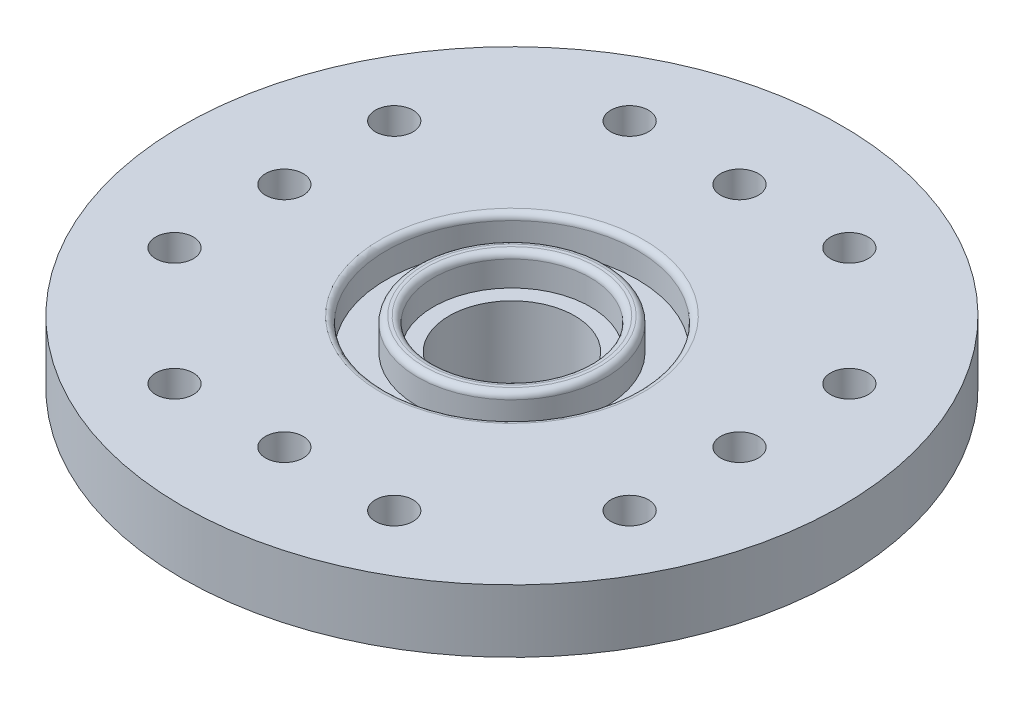
ISO-10303-21;
HEADER;
FILE_DESCRIPTION(('STEP AP214'),'2;1');
FILE_NAME('part.step','',(''),(''),'','','');
FILE_SCHEMA(('AUTOMOTIVE_DESIGN { 1 0 10303 214 1 1 1 1 }'));
ENDSEC;
DATA;
#1=APPLICATION_CONTEXT('core data for automotive mechanical design processes');
#2=APPLICATION_PROTOCOL_DEFINITION('international standard','automotive_design',2000,#1);
#3=PRODUCT_CONTEXT('',#1,'mechanical');
#4=PRODUCT('Part','Part','',(#3));
#5=PRODUCT_RELATED_PRODUCT_CATEGORY('part','',(#4));
#6=PRODUCT_DEFINITION_FORMATION('','',#4);
#7=PRODUCT_DEFINITION_CONTEXT('part definition',#1,'design');
#8=PRODUCT_DEFINITION('design','',#6,#7);
#9=PRODUCT_DEFINITION_SHAPE('','',#8);
#10=(LENGTH_UNIT() NAMED_UNIT(*) SI_UNIT(.MILLI.,.METRE.));
#11=(NAMED_UNIT(*) PLANE_ANGLE_UNIT() SI_UNIT($,.RADIAN.));
#12=(NAMED_UNIT(*) SI_UNIT($,.STERADIAN.) SOLID_ANGLE_UNIT());
#13=UNCERTAINTY_MEASURE_WITH_UNIT(LENGTH_MEASURE(1.E-05),#10,'distance_accuracy_value','');
#14=(GEOMETRIC_REPRESENTATION_CONTEXT(3) GLOBAL_UNCERTAINTY_ASSIGNED_CONTEXT((#13)) GLOBAL_UNIT_ASSIGNED_CONTEXT((#10,
#11,#12)) REPRESENTATION_CONTEXT('',''));
#15=CARTESIAN_POINT('',(0.,0.,0.));
#16=DIRECTION('',(0.,0.,1.));
#17=DIRECTION('',(1.,0.,0.));
#18=AXIS2_PLACEMENT_3D('',#15,#16,#17);
#19=CARTESIAN_POINT('',(0.,-3.,0.));
#20=DIRECTION('',(0.,1.,0.));
#21=DIRECTION('',(0.,0.,1.));
#22=AXIS2_PLACEMENT_3D('',#19,#20,#21);
#23=CYLINDRICAL_SURFACE('',#22,2.);
#24=CARTESIAN_POINT('',(0.,-3.,0.));
#25=DIRECTION('',(0.,-1.,0.));
#26=DIRECTION('',(0.,0.,-1.));
#27=AXIS2_PLACEMENT_3D('',#24,#25,#26);
#28=CIRCLE('',#27,2.);
#29=CARTESIAN_POINT('',(0.,-3.,-2.));
#30=VERTEX_POINT('',#29);
#31=EDGE_CURVE('E153',#30,#30,#28,.T.);
#32=ORIENTED_EDGE('',*,*,#31,.T.);
#33=EDGE_LOOP('',(#32));
#34=FACE_BOUND('',#33,.T.);
#35=CARTESIAN_POINT('',(0.,1.,0.));
#36=DIRECTION('',(0.,1.,0.));
#37=DIRECTION('',(0.,0.,1.));
#38=AXIS2_PLACEMENT_3D('',#35,#36,#37);
#39=CIRCLE('',#38,2.);
#40=CARTESIAN_POINT('',(0.,1.,2.));
#41=VERTEX_POINT('',#40);
#42=EDGE_CURVE('E132',#41,#41,#39,.T.);
#43=ORIENTED_EDGE('',*,*,#42,.T.);
#44=EDGE_LOOP('',(#43));
#45=FACE_BOUND('',#44,.T.);
#46=ADVANCED_FACE('F36',(#34,#45),#23,.F.);
#47=CARTESIAN_POINT('',(0.,2.,0.));
#48=DIRECTION('',(0.,-1.,0.));
#49=DIRECTION('',(0.,0.,-1.));
#50=AXIS2_PLACEMENT_3D('',#47,#48,#49);
#51=CYLINDRICAL_SURFACE('',#50,10.5);
#52=CARTESIAN_POINT('',(0.,2.,0.));
#53=DIRECTION('',(0.,1.,0.));
#54=DIRECTION('',(0.,0.,1.));
#55=AXIS2_PLACEMENT_3D('',#52,#53,#54);
#56=CIRCLE('',#55,10.5);
#57=CARTESIAN_POINT('',(0.,2.,10.5));
#58=VERTEX_POINT('',#57);
#59=EDGE_CURVE('E148',#58,#58,#56,.T.);
#60=ORIENTED_EDGE('',*,*,#59,.F.);
#61=EDGE_LOOP('',(#60));
#62=FACE_BOUND('',#61,.T.);
#63=CARTESIAN_POINT('',(0.,0.,0.));
#64=DIRECTION('',(0.,1.,0.));
#65=DIRECTION('',(0.,0.,1.));
#66=AXIS2_PLACEMENT_3D('',#63,#64,#65);
#67=CIRCLE('',#66,10.5);
#68=CARTESIAN_POINT('',(0.,0.,10.5));
#69=VERTEX_POINT('',#68);
#70=EDGE_CURVE('E149',#69,#69,#67,.T.);
#71=ORIENTED_EDGE('',*,*,#70,.T.);
#72=EDGE_LOOP('',(#71));
#73=FACE_BOUND('',#72,.T.);
#74=ADVANCED_FACE('F211',(#62,#73),#51,.T.);
#75=CARTESIAN_POINT('',(0.,2.,0.));
#76=DIRECTION('',(0.,1.,0.));
#77=DIRECTION('',(0.,0.,1.));
#78=AXIS2_PLACEMENT_3D('',#75,#76,#77);
#79=PLANE('',#78);
#80=CARTESIAN_POINT('',(0.,2.,0.));
#81=DIRECTION('',(0.,1.,0.));
#82=DIRECTION('',(0.,0.,1.));
#83=AXIS2_PLACEMENT_3D('',#80,#81,#82);
#84=CIRCLE('',#83,4.2);
#85=CARTESIAN_POINT('',(0.,2.,4.2));
#86=VERTEX_POINT('',#85);
#87=EDGE_CURVE('E10',#86,#86,#84,.F.);
#88=ORIENTED_EDGE('',*,*,#87,.T.);
#89=EDGE_LOOP('',(#88));
#90=FACE_BOUND('',#89,.T.);
#91=CARTESIAN_POINT('',(7.24999999999994,2.,-3.50000000000008));
#92=DIRECTION('',(0.,1.,0.));
#93=DIRECTION('',(-1.,0.,0.));
#94=AXIS2_PLACEMENT_3D('',#91,#92,#93);
#95=CIRCLE('',#94,0.6);
#96=CARTESIAN_POINT('',(6.64999999999994,2.,-3.50000000000007));
#97=VERTEX_POINT('',#96);
#98=EDGE_CURVE('E77',#97,#97,#95,.T.);
#99=ORIENTED_EDGE('',*,*,#98,.F.);
#100=EDGE_LOOP('',(#99));
#101=FACE_BOUND('',#100,.T.);
#102=CARTESIAN_POINT('',(7.25000000000004,2.,3.49999999999992));
#103=DIRECTION('',(0.,1.,0.));
#104=DIRECTION('',(-1.,0.,0.));
#105=AXIS2_PLACEMENT_3D('',#102,#103,#104);
#106=CIRCLE('',#105,0.6);
#107=CARTESIAN_POINT('',(6.65000000000004,2.,3.49999999999993));
#108=VERTEX_POINT('',#107);
#109=EDGE_CURVE('E76',#108,#108,#106,.T.);
#110=ORIENTED_EDGE('',*,*,#109,.F.);
#111=EDGE_LOOP('',(#110));
#112=FACE_BOUND('',#111,.T.);
#113=CARTESIAN_POINT('',(7.25,2.,0.));
#114=DIRECTION('',(0.,1.,0.));
#115=DIRECTION('',(-1.,0.,0.));
#116=AXIS2_PLACEMENT_3D('',#113,#114,#115);
#117=CIRCLE('',#116,0.6);
#118=CARTESIAN_POINT('',(6.65,2.,0.));
#119=VERTEX_POINT('',#118);
#120=EDGE_CURVE('E82',#119,#119,#117,.T.);
#121=ORIENTED_EDGE('',*,*,#120,.F.);
#122=EDGE_LOOP('',(#121));
#123=FACE_BOUND('',#122,.T.);
#124=CARTESIAN_POINT('',(3.5,2.,7.24999999999998));
#125=DIRECTION('',(0.,1.,0.));
#126=DIRECTION('',(0.,0.,-1.));
#127=AXIS2_PLACEMENT_3D('',#124,#125,#126);
#128=CIRCLE('',#127,0.6);
#129=CARTESIAN_POINT('',(3.5,2.,6.64999999999998));
#130=VERTEX_POINT('',#129);
#131=EDGE_CURVE('E86',#130,#130,#128,.T.);
#132=ORIENTED_EDGE('',*,*,#131,.F.);
#133=EDGE_LOOP('',(#132));
#134=FACE_BOUND('',#133,.T.);
#135=CARTESIAN_POINT('',(-3.5,2.,7.25));
#136=DIRECTION('',(0.,1.,0.));
#137=DIRECTION('',(0.,0.,-1.));
#138=AXIS2_PLACEMENT_3D('',#135,#136,#137);
#139=CIRCLE('',#138,0.6);
#140=CARTESIAN_POINT('',(-3.5,2.,6.65));
#141=VERTEX_POINT('',#140);
#142=EDGE_CURVE('E91',#141,#141,#139,.T.);
#143=ORIENTED_EDGE('',*,*,#142,.F.);
#144=EDGE_LOOP('',(#143));
#145=FACE_BOUND('',#144,.T.);
#146=CARTESIAN_POINT('',(0.,2.,7.25));
#147=DIRECTION('',(0.,1.,0.));
#148=DIRECTION('',(0.,0.,-1.));
#149=AXIS2_PLACEMENT_3D('',#146,#147,#148);
#150=CIRCLE('',#149,0.6);
#151=CARTESIAN_POINT('',(0.,2.,6.65));
#152=VERTEX_POINT('',#151);
#153=EDGE_CURVE('E96',#152,#152,#150,.T.);
#154=ORIENTED_EDGE('',*,*,#153,.F.);
#155=EDGE_LOOP('',(#154));
#156=FACE_BOUND('',#155,.T.);
#157=CARTESIAN_POINT('',(-7.24999999999996,2.,3.50000000000003));
#158=DIRECTION('',(0.,1.,0.));
#159=DIRECTION('',(1.,0.,0.));
#160=AXIS2_PLACEMENT_3D('',#157,#158,#159);
#161=CIRCLE('',#160,0.6);
#162=CARTESIAN_POINT('',(-6.64999999999996,2.,3.50000000000002));
#163=VERTEX_POINT('',#162);
#164=EDGE_CURVE('E101',#163,#163,#161,.T.);
#165=ORIENTED_EDGE('',*,*,#164,.F.);
#166=EDGE_LOOP('',(#165));
#167=FACE_BOUND('',#166,.T.);
#168=CARTESIAN_POINT('',(-7.25000000000001,2.,-3.49999999999998));
#169=DIRECTION('',(0.,1.,0.));
#170=DIRECTION('',(1.,0.,0.));
#171=AXIS2_PLACEMENT_3D('',#168,#169,#170);
#172=CIRCLE('',#171,0.6);
#173=CARTESIAN_POINT('',(-6.65000000000001,2.,-3.49999999999998));
#174=VERTEX_POINT('',#173);
#175=EDGE_CURVE('E106',#174,#174,#172,.T.);
#176=ORIENTED_EDGE('',*,*,#175,.F.);
#177=EDGE_LOOP('',(#176));
#178=FACE_BOUND('',#177,.T.);
#179=CARTESIAN_POINT('',(-7.25,2.,0.));
#180=DIRECTION('',(0.,1.,0.));
#181=DIRECTION('',(1.,0.,0.));
#182=AXIS2_PLACEMENT_3D('',#179,#180,#181);
#183=CIRCLE('',#182,0.6);
#184=CARTESIAN_POINT('',(-6.65,2.,0.));
#185=VERTEX_POINT('',#184);
#186=EDGE_CURVE('E111',#185,#185,#183,.T.);
#187=ORIENTED_EDGE('',*,*,#186,.F.);
#188=EDGE_LOOP('',(#187));
#189=FACE_BOUND('',#188,.T.);
#190=CARTESIAN_POINT('',(-3.5,2.,-7.24999999999998));
#191=DIRECTION('',(0.,1.,0.));
#192=DIRECTION('',(0.,0.,1.));
#193=AXIS2_PLACEMENT_3D('',#190,#191,#192);
#194=CIRCLE('',#193,0.6);
#195=CARTESIAN_POINT('',(-3.5,2.,-6.64999999999998));
#196=VERTEX_POINT('',#195);
#197=EDGE_CURVE('E116',#196,#196,#194,.T.);
#198=ORIENTED_EDGE('',*,*,#197,.F.);
#199=EDGE_LOOP('',(#198));
#200=FACE_BOUND('',#199,.T.);
#201=CARTESIAN_POINT('',(3.5,2.,-7.25));
#202=DIRECTION('',(0.,1.,0.));
#203=DIRECTION('',(0.,0.,1.));
#204=AXIS2_PLACEMENT_3D('',#201,#202,#203);
#205=CIRCLE('',#204,0.6);
#206=CARTESIAN_POINT('',(3.5,2.,-6.65));
#207=VERTEX_POINT('',#206);
#208=EDGE_CURVE('E121',#207,#207,#205,.T.);
#209=ORIENTED_EDGE('',*,*,#208,.F.);
#210=EDGE_LOOP('',(#209));
#211=FACE_BOUND('',#210,.T.);
#212=CARTESIAN_POINT('',(0.,2.,-7.25));
#213=DIRECTION('',(0.,1.,0.));
#214=DIRECTION('',(0.,0.,1.));
#215=AXIS2_PLACEMENT_3D('',#212,#213,#214);
#216=CIRCLE('',#215,0.6);
#217=CARTESIAN_POINT('',(0.,2.,-6.65));
#218=VERTEX_POINT('',#217);
#219=EDGE_CURVE('E126',#218,#218,#216,.T.);
#220=ORIENTED_EDGE('',*,*,#219,.F.);
#221=EDGE_LOOP('',(#220));
#222=FACE_BOUND('',#221,.T.);
#223=ORIENTED_EDGE('',*,*,#59,.T.);
#224=EDGE_LOOP('',(#223));
#225=FACE_BOUND('',#224,.T.);
#226=ADVANCED_FACE('F207',(#90,#101,#112,#123,#134,#145,#156,#167,#178,#189,#200,#211,#222,
#225),#79,.T.);
#227=CARTESIAN_POINT('',(0.,0.,0.));
#228=DIRECTION('',(0.,1.,0.));
#229=DIRECTION('',(0.,0.,1.));
#230=AXIS2_PLACEMENT_3D('',#227,#228,#229);
#231=PLANE('',#230);
#232=CARTESIAN_POINT('',(7.24999999999994,0.,-3.50000000000008));
#233=DIRECTION('',(0.,1.,0.));
#234=DIRECTION('',(0.,0.,1.));
#235=AXIS2_PLACEMENT_3D('',#232,#233,#234);
#236=CIRCLE('',#235,0.6);
#237=CARTESIAN_POINT('',(7.24999999999994,0.,-2.90000000000008));
#238=VERTEX_POINT('',#237);
#239=EDGE_CURVE('E72',#238,#238,#236,.T.);
#240=ORIENTED_EDGE('',*,*,#239,.T.);
#241=EDGE_LOOP('',(#240));
#242=FACE_BOUND('',#241,.T.);
#243=CARTESIAN_POINT('',(7.25000000000004,0.,3.49999999999992));
#244=DIRECTION('',(0.,1.,0.));
#245=DIRECTION('',(0.,0.,1.));
#246=AXIS2_PLACEMENT_3D('',#243,#244,#245);
#247=CIRCLE('',#246,0.6);
#248=CARTESIAN_POINT('',(7.25000000000004,0.,4.09999999999992));
#249=VERTEX_POINT('',#248);
#250=EDGE_CURVE('E78',#249,#249,#247,.T.);
#251=ORIENTED_EDGE('',*,*,#250,.T.);
#252=EDGE_LOOP('',(#251));
#253=FACE_BOUND('',#252,.T.);
#254=CARTESIAN_POINT('',(7.25,0.,0.));
#255=DIRECTION('',(0.,1.,0.));
#256=DIRECTION('',(0.,0.,1.));
#257=AXIS2_PLACEMENT_3D('',#254,#255,#256);
#258=CIRCLE('',#257,0.6);
#259=CARTESIAN_POINT('',(7.25,0.,0.599999999999924));
#260=VERTEX_POINT('',#259);
#261=EDGE_CURVE('E83',#260,#260,#258,.T.);
#262=ORIENTED_EDGE('',*,*,#261,.T.);
#263=EDGE_LOOP('',(#262));
#264=FACE_BOUND('',#263,.T.);
#265=CARTESIAN_POINT('',(3.5,0.,7.24999999999998));
#266=DIRECTION('',(0.,1.,0.));
#267=DIRECTION('',(0.,0.,1.));
#268=AXIS2_PLACEMENT_3D('',#265,#266,#267);
#269=CIRCLE('',#268,0.6);
#270=CARTESIAN_POINT('',(3.5,0.,7.84999999999997));
#271=VERTEX_POINT('',#270);
#272=EDGE_CURVE('E87',#271,#271,#269,.T.);
#273=ORIENTED_EDGE('',*,*,#272,.T.);
#274=EDGE_LOOP('',(#273));
#275=FACE_BOUND('',#274,.T.);
#276=CARTESIAN_POINT('',(-3.5,0.,7.25));
#277=DIRECTION('',(0.,1.,0.));
#278=DIRECTION('',(0.,0.,1.));
#279=AXIS2_PLACEMENT_3D('',#276,#277,#278);
#280=CIRCLE('',#279,0.6);
#281=CARTESIAN_POINT('',(-3.5,0.,7.85));
#282=VERTEX_POINT('',#281);
#283=EDGE_CURVE('E92',#282,#282,#280,.T.);
#284=ORIENTED_EDGE('',*,*,#283,.T.);
#285=EDGE_LOOP('',(#284));
#286=FACE_BOUND('',#285,.T.);
#287=CARTESIAN_POINT('',(0.,0.,7.25));
#288=DIRECTION('',(0.,1.,0.));
#289=DIRECTION('',(0.,0.,1.));
#290=AXIS2_PLACEMENT_3D('',#287,#288,#289);
#291=CIRCLE('',#290,0.6);
#292=CARTESIAN_POINT('',(0.,0.,7.85));
#293=VERTEX_POINT('',#292);
#294=EDGE_CURVE('E97',#293,#293,#291,.T.);
#295=ORIENTED_EDGE('',*,*,#294,.T.);
#296=EDGE_LOOP('',(#295));
#297=FACE_BOUND('',#296,.T.);
#298=CARTESIAN_POINT('',(-7.24999999999996,0.,3.50000000000003));
#299=DIRECTION('',(0.,1.,0.));
#300=DIRECTION('',(0.,0.,1.));
#301=AXIS2_PLACEMENT_3D('',#298,#299,#300);
#302=CIRCLE('',#301,0.6);
#303=CARTESIAN_POINT('',(-7.24999999999996,0.,4.10000000000002));
#304=VERTEX_POINT('',#303);
#305=EDGE_CURVE('E102',#304,#304,#302,.T.);
#306=ORIENTED_EDGE('',*,*,#305,.T.);
#307=EDGE_LOOP('',(#306));
#308=FACE_BOUND('',#307,.T.);
#309=CARTESIAN_POINT('',(-7.25000000000001,0.,-3.49999999999998));
#310=DIRECTION('',(0.,1.,0.));
#311=DIRECTION('',(0.,0.,1.));
#312=AXIS2_PLACEMENT_3D('',#309,#310,#311);
#313=CIRCLE('',#312,0.6);
#314=CARTESIAN_POINT('',(-7.25000000000001,0.,-2.89999999999998));
#315=VERTEX_POINT('',#314);
#316=EDGE_CURVE('E107',#315,#315,#313,.T.);
#317=ORIENTED_EDGE('',*,*,#316,.T.);
#318=EDGE_LOOP('',(#317));
#319=FACE_BOUND('',#318,.T.);
#320=CARTESIAN_POINT('',(-7.25,0.,0.));
#321=DIRECTION('',(0.,1.,0.));
#322=DIRECTION('',(0.,0.,1.));
#323=AXIS2_PLACEMENT_3D('',#320,#321,#322);
#324=CIRCLE('',#323,0.6);
#325=CARTESIAN_POINT('',(-7.25,0.,0.600000000000025));
#326=VERTEX_POINT('',#325);
#327=EDGE_CURVE('E112',#326,#326,#324,.T.);
#328=ORIENTED_EDGE('',*,*,#327,.T.);
#329=EDGE_LOOP('',(#328));
#330=FACE_BOUND('',#329,.T.);
#331=CARTESIAN_POINT('',(-3.5,0.,-7.24999999999998));
#332=DIRECTION('',(0.,1.,0.));
#333=DIRECTION('',(0.,0.,1.));
#334=AXIS2_PLACEMENT_3D('',#331,#332,#333);
#335=CIRCLE('',#334,0.6);
#336=CARTESIAN_POINT('',(-3.5,0.,-6.64999999999998));
#337=VERTEX_POINT('',#336);
#338=EDGE_CURVE('E117',#337,#337,#335,.T.);
#339=ORIENTED_EDGE('',*,*,#338,.T.);
#340=EDGE_LOOP('',(#339));
#341=FACE_BOUND('',#340,.T.);
#342=CARTESIAN_POINT('',(3.5,0.,-7.25));
#343=DIRECTION('',(0.,1.,0.));
#344=DIRECTION('',(0.,0.,1.));
#345=AXIS2_PLACEMENT_3D('',#342,#343,#344);
#346=CIRCLE('',#345,0.6);
#347=CARTESIAN_POINT('',(3.5,0.,-6.65));
#348=VERTEX_POINT('',#347);
#349=EDGE_CURVE('E122',#348,#348,#346,.T.);
#350=ORIENTED_EDGE('',*,*,#349,.T.);
#351=EDGE_LOOP('',(#350));
#352=FACE_BOUND('',#351,.T.);
#353=CARTESIAN_POINT('',(0.,0.,-7.25));
#354=DIRECTION('',(0.,1.,0.));
#355=DIRECTION('',(0.,0.,1.));
#356=AXIS2_PLACEMENT_3D('',#353,#354,#355);
#357=CIRCLE('',#356,0.6);
#358=CARTESIAN_POINT('',(0.,0.,-6.65));
#359=VERTEX_POINT('',#358);
#360=EDGE_CURVE('E127',#359,#359,#357,.T.);
#361=ORIENTED_EDGE('',*,*,#360,.T.);
#362=EDGE_LOOP('',(#361));
#363=FACE_BOUND('',#362,.T.);
#364=CARTESIAN_POINT('',(0.,0.,0.));
#365=DIRECTION('',(0.,1.,0.));
#366=DIRECTION('',(0.,0.,1.));
#367=AXIS2_PLACEMENT_3D('',#364,#365,#366);
#368=CIRCLE('',#367,4.);
#369=CARTESIAN_POINT('',(0.,0.,4.));
#370=VERTEX_POINT('',#369);
#371=EDGE_CURVE('E144',#370,#370,#368,.F.);
#372=ORIENTED_EDGE('',*,*,#371,.F.);
#373=EDGE_LOOP('',(#372));
#374=FACE_BOUND('',#373,.T.);
#375=ORIENTED_EDGE('',*,*,#70,.F.);
#376=EDGE_LOOP('',(#375));
#377=FACE_BOUND('',#376,.T.);
#378=ADVANCED_FACE('F210',(#242,#253,#264,#275,#286,#297,#308,#319,#330,#341,#352,#363,#374,
#377),#231,.F.);
#379=CARTESIAN_POINT('',(0.,-3.,0.));
#380=DIRECTION('',(0.,-1.,0.));
#381=DIRECTION('',(0.,0.,-1.));
#382=AXIS2_PLACEMENT_3D('',#379,#380,#381);
#383=PLANE('',#382);
#384=CARTESIAN_POINT('',(0.,-3.,0.));
#385=DIRECTION('',(0.,-1.,0.));
#386=DIRECTION('',(0.,0.,-1.));
#387=AXIS2_PLACEMENT_3D('',#384,#385,#386);
#388=CIRCLE('',#387,3.);
#389=CARTESIAN_POINT('',(0.,-3.,-3.));
#390=VERTEX_POINT('',#389);
#391=EDGE_CURVE('E140',#390,#390,#388,.T.);
#392=ORIENTED_EDGE('',*,*,#391,.T.);
#393=EDGE_LOOP('',(#392));
#394=FACE_BOUND('',#393,.T.);
#395=ORIENTED_EDGE('',*,*,#31,.F.);
#396=EDGE_LOOP('',(#395));
#397=FACE_BOUND('',#396,.T.);
#398=ADVANCED_FACE('F244',(#394,#397),#383,.T.);
#399=CARTESIAN_POINT('',(0.,-3.,0.));
#400=DIRECTION('',(0.,1.,0.));
#401=DIRECTION('',(0.,0.,1.));
#402=AXIS2_PLACEMENT_3D('',#399,#400,#401);
#403=CYLINDRICAL_SURFACE('',#402,4.);
#404=CARTESIAN_POINT('',(0.,-2.,0.));
#405=DIRECTION('',(0.,-1.,0.));
#406=DIRECTION('',(0.,0.,-1.));
#407=AXIS2_PLACEMENT_3D('',#404,#405,#406);
#408=CIRCLE('',#407,4.);
#409=CARTESIAN_POINT('',(0.,-2.,-4.));
#410=VERTEX_POINT('',#409);
#411=EDGE_CURVE('E71',#410,#410,#408,.F.);
#412=ORIENTED_EDGE('',*,*,#411,.T.);
#413=EDGE_LOOP('',(#412));
#414=FACE_BOUND('',#413,.T.);
#415=ORIENTED_EDGE('',*,*,#371,.T.);
#416=EDGE_LOOP('',(#415));
#417=FACE_BOUND('',#416,.T.);
#418=ADVANCED_FACE('F250',(#414,#417),#403,.T.);
#419=CARTESIAN_POINT('',(0.,-2.,0.));
#420=DIRECTION('',(0.,-1.,0.));
#421=DIRECTION('',(0.,0.,-1.));
#422=AXIS2_PLACEMENT_3D('',#419,#420,#421);
#423=TOROIDAL_SURFACE('',#422,3.,1.);
#424=ORIENTED_EDGE('',*,*,#411,.F.);
#425=EDGE_LOOP('',(#424));
#426=FACE_BOUND('',#425,.T.);
#427=ORIENTED_EDGE('',*,*,#391,.F.);
#428=EDGE_LOOP('',(#427));
#429=FACE_BOUND('',#428,.T.);
#430=ADVANCED_FACE('F265',(#426,#429),#423,.T.);
#431=CARTESIAN_POINT('',(0.,1.,0.));
#432=DIRECTION('',(0.,1.,0.));
#433=DIRECTION('',(0.,0.,1.));
#434=AXIS2_PLACEMENT_3D('',#431,#432,#433);
#435=CYLINDRICAL_SURFACE('',#434,4.);
#436=CARTESIAN_POINT('',(0.,1.8,0.));
#437=DIRECTION('',(0.,1.,0.));
#438=DIRECTION('',(0.,0.,1.));
#439=AXIS2_PLACEMENT_3D('',#436,#437,#438);
#440=CIRCLE('',#439,4.);
#441=CARTESIAN_POINT('',(0.,1.8,4.));
#442=VERTEX_POINT('',#441);
#443=EDGE_CURVE('E44',#442,#442,#440,.T.);
#444=ORIENTED_EDGE('',*,*,#443,.T.);
#445=EDGE_LOOP('',(#444));
#446=FACE_BOUND('',#445,.T.);
#447=CARTESIAN_POINT('',(0.,1.,0.));
#448=DIRECTION('',(0.,1.,0.));
#449=DIRECTION('',(0.,0.,1.));
#450=AXIS2_PLACEMENT_3D('',#447,#448,#449);
#451=CIRCLE('',#450,4.);
#452=CARTESIAN_POINT('',(0.,1.,4.));
#453=VERTEX_POINT('',#452);
#454=EDGE_CURVE('E160',#453,#453,#451,.T.);
#455=ORIENTED_EDGE('',*,*,#454,.F.);
#456=EDGE_LOOP('',(#455));
#457=FACE_BOUND('',#456,.T.);
#458=ADVANCED_FACE('F261',(#446,#457),#435,.F.);
#459=CARTESIAN_POINT('',(0.,1.,0.));
#460=DIRECTION('',(0.,1.,0.));
#461=DIRECTION('',(0.,0.,1.));
#462=AXIS2_PLACEMENT_3D('',#459,#460,#461);
#463=PLANE('',#462);
#464=CARTESIAN_POINT('',(0.,1.,0.));
#465=DIRECTION('',(0.,1.,0.));
#466=DIRECTION('',(0.,0.,1.));
#467=AXIS2_PLACEMENT_3D('',#464,#465,#466);
#468=CIRCLE('',#467,3.);
#469=CARTESIAN_POINT('',(0.,1.,3.));
#470=VERTEX_POINT('',#469);
#471=EDGE_CURVE('E136',#470,#470,#468,.T.);
#472=ORIENTED_EDGE('',*,*,#471,.F.);
#473=EDGE_LOOP('',(#472));
#474=FACE_BOUND('',#473,.T.);
#475=ORIENTED_EDGE('',*,*,#454,.T.);
#476=EDGE_LOOP('',(#475));
#477=FACE_BOUND('',#476,.T.);
#478=ADVANCED_FACE('F283',(#474,#477),#463,.T.);
#479=CARTESIAN_POINT('',(0.,1.,0.));
#480=DIRECTION('',(0.,1.,0.));
#481=DIRECTION('',(0.,0.,1.));
#482=AXIS2_PLACEMENT_3D('',#479,#480,#481);
#483=CYLINDRICAL_SURFACE('',#482,3.);
#484=CARTESIAN_POINT('',(0.,1.8,0.));
#485=DIRECTION('',(0.,1.,0.));
#486=DIRECTION('',(0.,0.,1.));
#487=AXIS2_PLACEMENT_3D('',#484,#485,#486);
#488=CIRCLE('',#487,3.);
#489=CARTESIAN_POINT('',(0.,1.8,3.));
#490=VERTEX_POINT('',#489);
#491=EDGE_CURVE('E51',#490,#490,#488,.F.);
#492=ORIENTED_EDGE('',*,*,#491,.T.);
#493=EDGE_LOOP('',(#492));
#494=FACE_BOUND('',#493,.T.);
#495=ORIENTED_EDGE('',*,*,#471,.T.);
#496=EDGE_LOOP('',(#495));
#497=FACE_BOUND('',#496,.T.);
#498=ADVANCED_FACE('F301',(#494,#497),#483,.T.);
#499=CARTESIAN_POINT('',(0.,2.,0.));
#500=DIRECTION('',(0.,1.,0.));
#501=DIRECTION('',(0.,0.,1.));
#502=AXIS2_PLACEMENT_3D('',#499,#500,#501);
#503=CIRCLE('',#502,2.7);
#504=CARTESIAN_POINT('',(0.,2.,2.7));
#505=VERTEX_POINT('',#504);
#506=EDGE_CURVE('E58',#505,#505,#503,.F.);
#507=ORIENTED_EDGE('',*,*,#506,.T.);
#508=EDGE_LOOP('',(#507));
#509=FACE_BOUND('',#508,.T.);
#510=CARTESIAN_POINT('',(0.,2.,0.));
#511=DIRECTION('',(0.,1.,0.));
#512=DIRECTION('',(0.,0.,1.));
#513=AXIS2_PLACEMENT_3D('',#510,#511,#512);
#514=CIRCLE('',#513,2.8);
#515=CARTESIAN_POINT('',(0.,2.,2.8));
#516=VERTEX_POINT('',#515);
#517=EDGE_CURVE('E63',#516,#516,#514,.T.);
#518=ORIENTED_EDGE('',*,*,#517,.T.);
#519=EDGE_LOOP('',(#518));
#520=FACE_BOUND('',#519,.T.);
#521=ADVANCED_FACE('F213',(#509,#520),#79,.T.);
#522=CARTESIAN_POINT('',(0.,1.,0.));
#523=DIRECTION('',(0.,1.,0.));
#524=DIRECTION('',(0.,0.,1.));
#525=AXIS2_PLACEMENT_3D('',#522,#523,#524);
#526=CYLINDRICAL_SURFACE('',#525,2.5);
#527=CARTESIAN_POINT('',(0.,1.8,0.));
#528=DIRECTION('',(0.,1.,0.));
#529=DIRECTION('',(0.,0.,1.));
#530=AXIS2_PLACEMENT_3D('',#527,#528,#529);
#531=CIRCLE('',#530,2.5);
#532=CARTESIAN_POINT('',(0.,1.8,2.5));
#533=VERTEX_POINT('',#532);
#534=EDGE_CURVE('E67',#533,#533,#531,.T.);
#535=ORIENTED_EDGE('',*,*,#534,.T.);
#536=EDGE_LOOP('',(#535));
#537=FACE_BOUND('',#536,.T.);
#538=CARTESIAN_POINT('',(0.,1.,0.));
#539=DIRECTION('',(0.,1.,0.));
#540=DIRECTION('',(0.,0.,1.));
#541=AXIS2_PLACEMENT_3D('',#538,#539,#540);
#542=CIRCLE('',#541,2.5);
#543=CARTESIAN_POINT('',(0.,1.,2.5));
#544=VERTEX_POINT('',#543);
#545=EDGE_CURVE('E131',#544,#544,#542,.T.);
#546=ORIENTED_EDGE('',*,*,#545,.F.);
#547=EDGE_LOOP('',(#546));
#548=FACE_BOUND('',#547,.T.);
#549=ADVANCED_FACE('F300',(#537,#548),#526,.F.);
#550=CARTESIAN_POINT('',(0.,1.,0.));
#551=DIRECTION('',(0.,1.,0.));
#552=DIRECTION('',(0.,0.,1.));
#553=AXIS2_PLACEMENT_3D('',#550,#551,#552);
#554=PLANE('',#553);
#555=ORIENTED_EDGE('',*,*,#42,.F.);
#556=EDGE_LOOP('',(#555));
#557=FACE_BOUND('',#556,.T.);
#558=ORIENTED_EDGE('',*,*,#545,.T.);
#559=EDGE_LOOP('',(#558));
#560=FACE_BOUND('',#559,.T.);
#561=ADVANCED_FACE('F307',(#557,#560),#554,.T.);
#562=CARTESIAN_POINT('',(0.,-3.,-7.25));
#563=DIRECTION('',(0.,1.,0.));
#564=DIRECTION('',(0.,0.,1.));
#565=AXIS2_PLACEMENT_3D('',#562,#563,#564);
#566=CYLINDRICAL_SURFACE('',#565,0.6);
#567=ORIENTED_EDGE('',*,*,#219,.T.);
#568=EDGE_LOOP('',(#567));
#569=FACE_BOUND('',#568,.T.);
#570=ORIENTED_EDGE('',*,*,#360,.F.);
#571=EDGE_LOOP('',(#570));
#572=FACE_BOUND('',#571,.T.);
#573=ADVANCED_FACE('F319',(#569,#572),#566,.F.);
#574=CARTESIAN_POINT('',(3.5,-3.,-7.25));
#575=DIRECTION('',(0.,1.,0.));
#576=DIRECTION('',(0.,0.,1.));
#577=AXIS2_PLACEMENT_3D('',#574,#575,#576);
#578=CYLINDRICAL_SURFACE('',#577,0.6);
#579=ORIENTED_EDGE('',*,*,#208,.T.);
#580=EDGE_LOOP('',(#579));
#581=FACE_BOUND('',#580,.T.);
#582=ORIENTED_EDGE('',*,*,#349,.F.);
#583=EDGE_LOOP('',(#582));
#584=FACE_BOUND('',#583,.T.);
#585=ADVANCED_FACE('F325',(#581,#584),#578,.F.);
#586=CARTESIAN_POINT('',(-3.5,-3.,-7.24999999999998));
#587=DIRECTION('',(0.,1.,0.));
#588=DIRECTION('',(0.,0.,1.));
#589=AXIS2_PLACEMENT_3D('',#586,#587,#588);
#590=CYLINDRICAL_SURFACE('',#589,0.6);
#591=ORIENTED_EDGE('',*,*,#197,.T.);
#592=EDGE_LOOP('',(#591));
#593=FACE_BOUND('',#592,.T.);
#594=ORIENTED_EDGE('',*,*,#338,.F.);
#595=EDGE_LOOP('',(#594));
#596=FACE_BOUND('',#595,.T.);
#597=ADVANCED_FACE('F449',(#593,#596),#590,.F.);
#598=CARTESIAN_POINT('',(-7.25,-3.,0.));
#599=DIRECTION('',(0.,1.,0.));
#600=DIRECTION('',(0.,0.,1.));
#601=AXIS2_PLACEMENT_3D('',#598,#599,#600);
#602=CYLINDRICAL_SURFACE('',#601,0.6);
#603=ORIENTED_EDGE('',*,*,#186,.T.);
#604=EDGE_LOOP('',(#603));
#605=FACE_BOUND('',#604,.T.);
#606=ORIENTED_EDGE('',*,*,#327,.F.);
#607=EDGE_LOOP('',(#606));
#608=FACE_BOUND('',#607,.T.);
#609=ADVANCED_FACE('F441',(#605,#608),#602,.F.);
#610=CARTESIAN_POINT('',(-7.25000000000001,-3.,-3.49999999999998));
#611=DIRECTION('',(0.,1.,0.));
#612=DIRECTION('',(0.,0.,1.));
#613=AXIS2_PLACEMENT_3D('',#610,#611,#612);
#614=CYLINDRICAL_SURFACE('',#613,0.6);
#615=ORIENTED_EDGE('',*,*,#175,.T.);
#616=EDGE_LOOP('',(#615));
#617=FACE_BOUND('',#616,.T.);
#618=ORIENTED_EDGE('',*,*,#316,.F.);
#619=EDGE_LOOP('',(#618));
#620=FACE_BOUND('',#619,.T.);
#621=ADVANCED_FACE('F433',(#617,#620),#614,.F.);
#622=CARTESIAN_POINT('',(-7.24999999999996,-3.,3.50000000000003));
#623=DIRECTION('',(0.,1.,0.));
#624=DIRECTION('',(0.,0.,1.));
#625=AXIS2_PLACEMENT_3D('',#622,#623,#624);
#626=CYLINDRICAL_SURFACE('',#625,0.6);
#627=ORIENTED_EDGE('',*,*,#164,.T.);
#628=EDGE_LOOP('',(#627));
#629=FACE_BOUND('',#628,.T.);
#630=ORIENTED_EDGE('',*,*,#305,.F.);
#631=EDGE_LOOP('',(#630));
#632=FACE_BOUND('',#631,.T.);
#633=ADVANCED_FACE('F425',(#629,#632),#626,.F.);
#634=CARTESIAN_POINT('',(0.,-3.,7.25));
#635=DIRECTION('',(0.,1.,0.));
#636=DIRECTION('',(0.,0.,1.));
#637=AXIS2_PLACEMENT_3D('',#634,#635,#636);
#638=CYLINDRICAL_SURFACE('',#637,0.6);
#639=ORIENTED_EDGE('',*,*,#153,.T.);
#640=EDGE_LOOP('',(#639));
#641=FACE_BOUND('',#640,.T.);
#642=ORIENTED_EDGE('',*,*,#294,.F.);
#643=EDGE_LOOP('',(#642));
#644=FACE_BOUND('',#643,.T.);
#645=ADVANCED_FACE('F417',(#641,#644),#638,.F.);
#646=CARTESIAN_POINT('',(-3.5,-3.,7.25));
#647=DIRECTION('',(0.,1.,0.));
#648=DIRECTION('',(0.,0.,1.));
#649=AXIS2_PLACEMENT_3D('',#646,#647,#648);
#650=CYLINDRICAL_SURFACE('',#649,0.6);
#651=ORIENTED_EDGE('',*,*,#142,.T.);
#652=EDGE_LOOP('',(#651));
#653=FACE_BOUND('',#652,.T.);
#654=ORIENTED_EDGE('',*,*,#283,.F.);
#655=EDGE_LOOP('',(#654));
#656=FACE_BOUND('',#655,.T.);
#657=ADVANCED_FACE('F409',(#653,#656),#650,.F.);
#658=CARTESIAN_POINT('',(3.5,-3.,7.24999999999998));
#659=DIRECTION('',(0.,1.,0.));
#660=DIRECTION('',(0.,0.,1.));
#661=AXIS2_PLACEMENT_3D('',#658,#659,#660);
#662=CYLINDRICAL_SURFACE('',#661,0.6);
#663=ORIENTED_EDGE('',*,*,#131,.T.);
#664=EDGE_LOOP('',(#663));
#665=FACE_BOUND('',#664,.T.);
#666=ORIENTED_EDGE('',*,*,#272,.F.);
#667=EDGE_LOOP('',(#666));
#668=FACE_BOUND('',#667,.T.);
#669=ADVANCED_FACE('F401',(#665,#668),#662,.F.);
#670=CARTESIAN_POINT('',(7.25,-3.,0.));
#671=DIRECTION('',(0.,1.,0.));
#672=DIRECTION('',(0.,0.,1.));
#673=AXIS2_PLACEMENT_3D('',#670,#671,#672);
#674=CYLINDRICAL_SURFACE('',#673,0.6);
#675=ORIENTED_EDGE('',*,*,#120,.T.);
#676=EDGE_LOOP('',(#675));
#677=FACE_BOUND('',#676,.T.);
#678=ORIENTED_EDGE('',*,*,#261,.F.);
#679=EDGE_LOOP('',(#678));
#680=FACE_BOUND('',#679,.T.);
#681=ADVANCED_FACE('F393',(#677,#680),#674,.F.);
#682=CARTESIAN_POINT('',(7.25000000000004,-3.,3.49999999999992));
#683=DIRECTION('',(0.,1.,0.));
#684=DIRECTION('',(0.,0.,1.));
#685=AXIS2_PLACEMENT_3D('',#682,#683,#684);
#686=CYLINDRICAL_SURFACE('',#685,0.6);
#687=ORIENTED_EDGE('',*,*,#109,.T.);
#688=EDGE_LOOP('',(#687));
#689=FACE_BOUND('',#688,.T.);
#690=ORIENTED_EDGE('',*,*,#250,.F.);
#691=EDGE_LOOP('',(#690));
#692=FACE_BOUND('',#691,.T.);
#693=ADVANCED_FACE('F387',(#689,#692),#686,.F.);
#694=CARTESIAN_POINT('',(7.24999999999994,-3.,-3.50000000000008));
#695=DIRECTION('',(0.,1.,0.));
#696=DIRECTION('',(0.,0.,1.));
#697=AXIS2_PLACEMENT_3D('',#694,#695,#696);
#698=CYLINDRICAL_SURFACE('',#697,0.6);
#699=ORIENTED_EDGE('',*,*,#98,.T.);
#700=EDGE_LOOP('',(#699));
#701=FACE_BOUND('',#700,.T.);
#702=ORIENTED_EDGE('',*,*,#239,.F.);
#703=EDGE_LOOP('',(#702));
#704=FACE_BOUND('',#703,.T.);
#705=ADVANCED_FACE('F204',(#701,#704),#698,.F.);
#706=CARTESIAN_POINT('',(0.,1.8,0.));
#707=DIRECTION('',(0.,1.,0.));
#708=DIRECTION('',(0.,0.,1.));
#709=AXIS2_PLACEMENT_3D('',#706,#707,#708);
#710=TOROIDAL_SURFACE('',#709,2.7,0.2);
#711=ORIENTED_EDGE('',*,*,#506,.F.);
#712=EDGE_LOOP('',(#711));
#713=FACE_BOUND('',#712,.T.);
#714=ORIENTED_EDGE('',*,*,#534,.F.);
#715=EDGE_LOOP('',(#714));
#716=FACE_BOUND('',#715,.T.);
#717=ADVANCED_FACE('F285',(#713,#716),#710,.T.);
#718=CARTESIAN_POINT('',(0.,1.8,0.));
#719=DIRECTION('',(0.,1.,0.));
#720=DIRECTION('',(0.,0.,1.));
#721=AXIS2_PLACEMENT_3D('',#718,#719,#720);
#722=TOROIDAL_SURFACE('',#721,2.8,0.2);
#723=ORIENTED_EDGE('',*,*,#491,.F.);
#724=EDGE_LOOP('',(#723));
#725=FACE_BOUND('',#724,.T.);
#726=ORIENTED_EDGE('',*,*,#517,.F.);
#727=EDGE_LOOP('',(#726));
#728=FACE_BOUND('',#727,.T.);
#729=ADVANCED_FACE('F287',(#725,#728),#722,.T.);
#730=CARTESIAN_POINT('',(0.,1.8,0.));
#731=DIRECTION('',(0.,1.,0.));
#732=DIRECTION('',(0.,0.,1.));
#733=AXIS2_PLACEMENT_3D('',#730,#731,#732);
#734=TOROIDAL_SURFACE('',#733,4.2,0.2);
#735=ORIENTED_EDGE('',*,*,#87,.F.);
#736=EDGE_LOOP('',(#735));
#737=FACE_BOUND('',#736,.T.);
#738=ORIENTED_EDGE('',*,*,#443,.F.);
#739=EDGE_LOOP('',(#738));
#740=FACE_BOUND('',#739,.T.);
#741=ADVANCED_FACE('F38',(#737,#740),#734,.T.);
#742=CLOSED_SHELL('',(#46,#74,#226,#378,#398,#418,#430,#458,#478,#498,#521,#549,#561,#573,#585,
#597,#609,#621,#633,#645,#657,#669,#681,#693,#705,#717,#729,#741));
#743=MANIFOLD_SOLID_BREP('B2',#742);
#744=ADVANCED_BREP_SHAPE_REPRESENTATION('',(#18,#743),#14);
#745=SHAPE_DEFINITION_REPRESENTATION(#9,#744);
ENDSEC;
END-ISO-10303-21;
